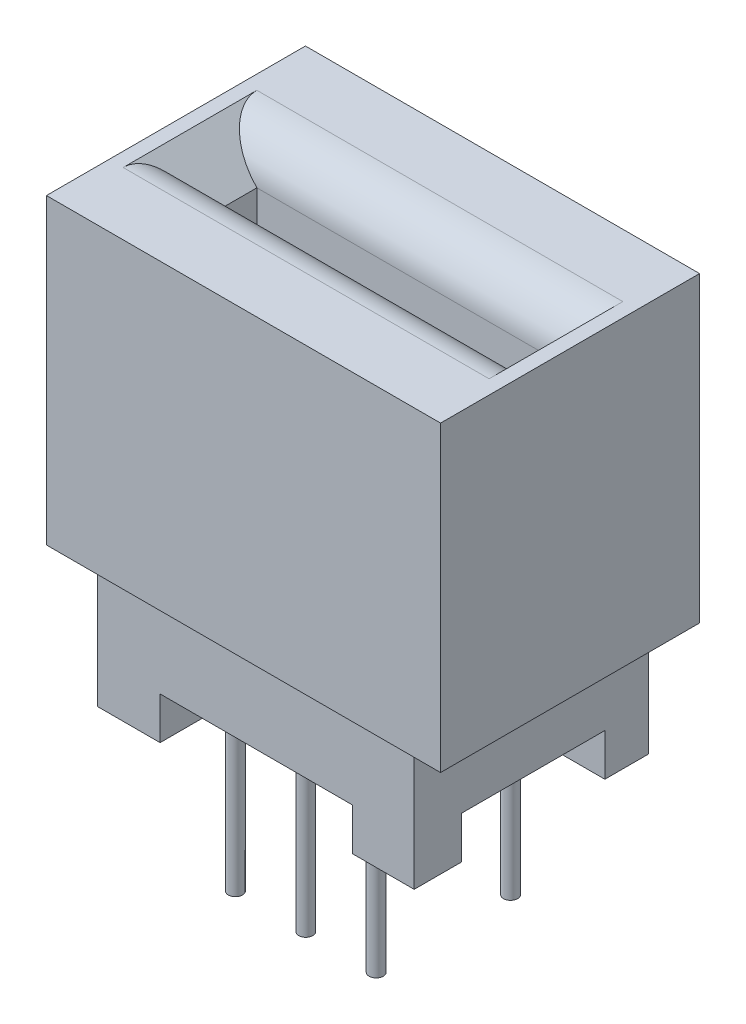
ISO-10303-21;
HEADER;
FILE_DESCRIPTION(('STEP AP214'),'2;1');
FILE_NAME('part.step','',(''),(''),'','','');
FILE_SCHEMA(('AUTOMOTIVE_DESIGN { 1 0 10303 214 1 1 1 1 }'));
ENDSEC;
DATA;
#1=APPLICATION_CONTEXT('core data for automotive mechanical design processes');
#2=APPLICATION_PROTOCOL_DEFINITION('international standard','automotive_design',2000,#1);
#3=PRODUCT_CONTEXT('',#1,'mechanical');
#4=PRODUCT('Part','Part','',(#3));
#5=PRODUCT_RELATED_PRODUCT_CATEGORY('part','',(#4));
#6=PRODUCT_DEFINITION_FORMATION('','',#4);
#7=PRODUCT_DEFINITION_CONTEXT('part definition',#1,'design');
#8=PRODUCT_DEFINITION('design','',#6,#7);
#9=PRODUCT_DEFINITION_SHAPE('','',#8);
#10=(LENGTH_UNIT() NAMED_UNIT(*) SI_UNIT(.MILLI.,.METRE.));
#11=(NAMED_UNIT(*) PLANE_ANGLE_UNIT() SI_UNIT($,.RADIAN.));
#12=(NAMED_UNIT(*) SI_UNIT($,.STERADIAN.) SOLID_ANGLE_UNIT());
#13=UNCERTAINTY_MEASURE_WITH_UNIT(LENGTH_MEASURE(1.E-05),#10,'distance_accuracy_value','');
#14=(GEOMETRIC_REPRESENTATION_CONTEXT(3) GLOBAL_UNCERTAINTY_ASSIGNED_CONTEXT((#13)) GLOBAL_UNIT_ASSIGNED_CONTEXT((#10,
#11,#12)) REPRESENTATION_CONTEXT('',''));
#15=CARTESIAN_POINT('',(0.,0.,0.));
#16=DIRECTION('',(0.,0.,1.));
#17=DIRECTION('',(1.,0.,0.));
#18=AXIS2_PLACEMENT_3D('',#15,#16,#17);
#19=CARTESIAN_POINT('',(-5.715,-13.97,-4.22910624853925));
#20=DIRECTION('',(0.,-1.,0.));
#21=DIRECTION('',(0.,0.,-1.));
#22=AXIS2_PLACEMENT_3D('',#19,#20,#21);
#23=PLANE('',#22);
#24=CARTESIAN_POINT('',(-2.54,-13.97,-2.4257));
#25=DIRECTION('',(0.,-1.,0.));
#26=DIRECTION('',(0.,0.,-1.));
#27=AXIS2_PLACEMENT_3D('',#24,#25,#26);
#28=CIRCLE('',#27,0.254);
#29=CARTESIAN_POINT('',(-2.54,-13.97,-2.6797));
#30=VERTEX_POINT('',#29);
#31=EDGE_CURVE('E246',#30,#30,#28,.T.);
#32=ORIENTED_EDGE('',*,*,#31,.F.);
#33=EDGE_LOOP('',(#32));
#34=FACE_BOUND('',#33,.T.);
#35=DIRECTION('',(-1.,0.,0.));
#36=VECTOR('',#35,1.);
#37=CARTESIAN_POINT('',(-5.715,-13.97,-2.65286698114892));
#38=LINE('',#37,#36);
#39=CARTESIAN_POINT('',(-3.45506017969269,-13.97,-2.65286698114892));
#40=VERTEX_POINT('',#39);
#41=CARTESIAN_POINT('',(-5.715,-13.97,-2.65286698114892));
#42=VERTEX_POINT('',#41);
#43=EDGE_CURVE('E257',#40,#42,#38,.T.);
#44=ORIENTED_EDGE('',*,*,#43,.F.);
#45=DIRECTION('',(0.,0.,1.));
#46=VECTOR('',#45,1.);
#47=CARTESIAN_POINT('',(-3.45506017969269,-13.97,-4.22910624853925));
#48=LINE('',#47,#46);
#49=CARTESIAN_POINT('',(-3.45506017969269,-13.97,-4.22910624853925));
#50=VERTEX_POINT('',#49);
#51=EDGE_CURVE('E250',#50,#40,#48,.T.);
#52=ORIENTED_EDGE('',*,*,#51,.F.);
#53=DIRECTION('',(1.,0.,0.));
#54=VECTOR('',#53,1.);
#55=CARTESIAN_POINT('',(-5.715,-13.97,-4.22910624853925));
#56=LINE('',#55,#54);
#57=CARTESIAN_POINT('',(3.48320730946616,-13.97,-4.22910624853925));
#58=VERTEX_POINT('',#57);
#59=EDGE_CURVE('E415',#50,#58,#56,.T.);
#60=ORIENTED_EDGE('',*,*,#59,.T.);
#61=DIRECTION('',(0.,0.,-1.));
#62=VECTOR('',#61,1.);
#63=CARTESIAN_POINT('',(3.48320730946616,-13.97,-4.22910624853925));
#64=LINE('',#63,#62);
#65=CARTESIAN_POINT('',(3.48320730946616,-13.97,-2.65286698114892));
#66=VERTEX_POINT('',#65);
#67=EDGE_CURVE('E281',#66,#58,#64,.T.);
#68=ORIENTED_EDGE('',*,*,#67,.F.);
#69=DIRECTION('',(-1.,0.,0.));
#70=VECTOR('',#69,1.);
#71=CARTESIAN_POINT('',(5.715,-13.97,-2.65286698114892));
#72=LINE('',#71,#70);
#73=CARTESIAN_POINT('',(5.715,-13.97,-2.65286698114892));
#74=VERTEX_POINT('',#73);
#75=EDGE_CURVE('E276',#74,#66,#72,.T.);
#76=ORIENTED_EDGE('',*,*,#75,.F.);
#77=DIRECTION('',(0.,0.,1.));
#78=VECTOR('',#77,1.);
#79=CARTESIAN_POINT('',(5.715,-13.97,4.22910624853925));
#80=LINE('',#79,#78);
#81=CARTESIAN_POINT('',(5.715,-13.97,2.52620489716843));
#82=VERTEX_POINT('',#81);
#83=EDGE_CURVE('E354',#74,#82,#80,.T.);
#84=ORIENTED_EDGE('',*,*,#83,.T.);
#85=DIRECTION('',(1.,0.,0.));
#86=VECTOR('',#85,1.);
#87=CARTESIAN_POINT('',(5.715,-13.97,2.52620489716843));
#88=LINE('',#87,#86);
#89=CARTESIAN_POINT('',(3.48320730946616,-13.97,2.52620489716843));
#90=VERTEX_POINT('',#89);
#91=EDGE_CURVE('E306',#90,#82,#88,.T.);
#92=ORIENTED_EDGE('',*,*,#91,.F.);
#93=DIRECTION('',(0.,0.,-1.));
#94=VECTOR('',#93,1.);
#95=CARTESIAN_POINT('',(3.48320730946616,-13.97,4.22910624853925));
#96=LINE('',#95,#94);
#97=CARTESIAN_POINT('',(3.48320730946616,-13.97,4.22910624853925));
#98=VERTEX_POINT('',#97);
#99=EDGE_CURVE('E301',#98,#90,#96,.T.);
#100=ORIENTED_EDGE('',*,*,#99,.F.);
#101=DIRECTION('',(-1.,0.,0.));
#102=VECTOR('',#101,1.);
#103=CARTESIAN_POINT('',(-5.715,-13.97,4.22910624853925));
#104=LINE('',#103,#102);
#105=CARTESIAN_POINT('',(-3.45506017969269,-13.97,4.22910624853925));
#106=VERTEX_POINT('',#105);
#107=EDGE_CURVE('E350',#98,#106,#104,.T.);
#108=ORIENTED_EDGE('',*,*,#107,.T.);
#109=DIRECTION('',(0.,0.,1.));
#110=VECTOR('',#109,1.);
#111=CARTESIAN_POINT('',(-3.45506017969269,-13.97,4.22910624853925));
#112=LINE('',#111,#110);
#113=CARTESIAN_POINT('',(-3.45506017969269,-13.97,2.52620489716843));
#114=VERTEX_POINT('',#113);
#115=EDGE_CURVE('E328',#114,#106,#112,.T.);
#116=ORIENTED_EDGE('',*,*,#115,.F.);
#117=DIRECTION('',(1.,0.,0.));
#118=VECTOR('',#117,1.);
#119=CARTESIAN_POINT('',(-5.715,-13.97,2.52620489716843));
#120=LINE('',#119,#118);
#121=CARTESIAN_POINT('',(-5.715,-13.97,2.52620489716843));
#122=VERTEX_POINT('',#121);
#123=EDGE_CURVE('E323',#122,#114,#120,.T.);
#124=ORIENTED_EDGE('',*,*,#123,.F.);
#125=DIRECTION('',(0.,0.,-1.));
#126=VECTOR('',#125,1.);
#127=CARTESIAN_POINT('',(-5.715,-13.97,4.22910624853925));
#128=LINE('',#127,#126);
#129=EDGE_CURVE('E372',#122,#42,#128,.T.);
#130=ORIENTED_EDGE('',*,*,#129,.T.);
#131=EDGE_LOOP('',(#44,#52,#60,#68,#76,#84,#92,#100,#108,#116,#124,#130));
#132=FACE_BOUND('',#131,.T.);
#133=CARTESIAN_POINT('',(0.,-13.97,-2.4257));
#134=DIRECTION('',(0.,-1.,0.));
#135=DIRECTION('',(0.,0.,-1.));
#136=AXIS2_PLACEMENT_3D('',#133,#134,#135);
#137=CIRCLE('',#136,0.254);
#138=CARTESIAN_POINT('',(0.,-13.97,-2.6797));
#139=VERTEX_POINT('',#138);
#140=EDGE_CURVE('E236',#139,#139,#137,.T.);
#141=ORIENTED_EDGE('',*,*,#140,.F.);
#142=EDGE_LOOP('',(#141));
#143=FACE_BOUND('',#142,.T.);
#144=CARTESIAN_POINT('',(2.54,-13.97,-2.4257));
#145=DIRECTION('',(0.,-1.,0.));
#146=DIRECTION('',(0.,0.,-1.));
#147=AXIS2_PLACEMENT_3D('',#144,#145,#146);
#148=CIRCLE('',#147,0.254);
#149=CARTESIAN_POINT('',(2.54,-13.97,-2.6797));
#150=VERTEX_POINT('',#149);
#151=EDGE_CURVE('E355',#150,#150,#148,.T.);
#152=ORIENTED_EDGE('',*,*,#151,.F.);
#153=EDGE_LOOP('',(#152));
#154=FACE_BOUND('',#153,.T.);
#155=CARTESIAN_POINT('',(-2.54,-13.97,2.4257));
#156=DIRECTION('',(0.,-1.,0.));
#157=DIRECTION('',(0.,0.,-1.));
#158=AXIS2_PLACEMENT_3D('',#155,#156,#157);
#159=CIRCLE('',#158,0.254);
#160=CARTESIAN_POINT('',(-2.54,-13.97,2.1717));
#161=VERTEX_POINT('',#160);
#162=EDGE_CURVE('E617',#161,#161,#159,.T.);
#163=ORIENTED_EDGE('',*,*,#162,.F.);
#164=EDGE_LOOP('',(#163));
#165=FACE_BOUND('',#164,.T.);
#166=CARTESIAN_POINT('',(0.,-13.97,2.4257));
#167=DIRECTION('',(0.,-1.,0.));
#168=DIRECTION('',(0.,0.,-1.));
#169=AXIS2_PLACEMENT_3D('',#166,#167,#168);
#170=CIRCLE('',#169,0.254);
#171=CARTESIAN_POINT('',(0.,-13.97,2.1717));
#172=VERTEX_POINT('',#171);
#173=EDGE_CURVE('E611',#172,#172,#170,.T.);
#174=ORIENTED_EDGE('',*,*,#173,.F.);
#175=EDGE_LOOP('',(#174));
#176=FACE_BOUND('',#175,.T.);
#177=CARTESIAN_POINT('',(2.54,-13.97,2.4257));
#178=DIRECTION('',(0.,-1.,0.));
#179=DIRECTION('',(0.,0.,-1.));
#180=AXIS2_PLACEMENT_3D('',#177,#178,#179);
#181=CIRCLE('',#180,0.254);
#182=CARTESIAN_POINT('',(2.54,-13.97,2.1717));
#183=VERTEX_POINT('',#182);
#184=EDGE_CURVE('E605',#183,#183,#181,.T.);
#185=ORIENTED_EDGE('',*,*,#184,.F.);
#186=EDGE_LOOP('',(#185));
#187=FACE_BOUND('',#186,.T.);
#188=ADVANCED_FACE('F31',(#34,#132,#143,#154,#165,#176,#187),#23,.T.);
#189=CARTESIAN_POINT('',(-7.112,-10.922,-4.6736));
#190=DIRECTION('',(0.,-1.,0.));
#191=DIRECTION('',(0.,0.,-1.));
#192=AXIS2_PLACEMENT_3D('',#189,#190,#191);
#193=PLANE('',#192);
#194=DIRECTION('',(0.,0.,1.));
#195=VECTOR('',#194,1.);
#196=CARTESIAN_POINT('',(-7.112,-10.922,4.6736));
#197=LINE('',#196,#195);
#198=CARTESIAN_POINT('',(-7.112,-10.922,-4.6736));
#199=VERTEX_POINT('',#198);
#200=CARTESIAN_POINT('',(-7.112,-10.922,4.6736));
#201=VERTEX_POINT('',#200);
#202=EDGE_CURVE('E383',#199,#201,#197,.T.);
#203=ORIENTED_EDGE('',*,*,#202,.F.);
#204=DIRECTION('',(-1.,0.,0.));
#205=VECTOR('',#204,1.);
#206=CARTESIAN_POINT('',(-7.112,-10.922,-4.6736));
#207=LINE('',#206,#205);
#208=CARTESIAN_POINT('',(7.112,-10.922,-4.6736));
#209=VERTEX_POINT('',#208);
#210=EDGE_CURVE('E393',#209,#199,#207,.T.);
#211=ORIENTED_EDGE('',*,*,#210,.F.);
#212=DIRECTION('',(0.,0.,-1.));
#213=VECTOR('',#212,1.);
#214=CARTESIAN_POINT('',(7.112,-10.922,4.6736));
#215=LINE('',#214,#213);
#216=CARTESIAN_POINT('',(7.112,-10.922,4.6736));
#217=VERTEX_POINT('',#216);
#218=EDGE_CURVE('E390',#217,#209,#215,.T.);
#219=ORIENTED_EDGE('',*,*,#218,.F.);
#220=DIRECTION('',(1.,0.,0.));
#221=VECTOR('',#220,1.);
#222=CARTESIAN_POINT('',(-7.112,-10.922,4.6736));
#223=LINE('',#222,#221);
#224=EDGE_CURVE('E386',#201,#217,#223,.T.);
#225=ORIENTED_EDGE('',*,*,#224,.F.);
#226=EDGE_LOOP('',(#203,#211,#219,#225));
#227=FACE_BOUND('',#226,.T.);
#228=DIRECTION('',(1.,0.,0.));
#229=VECTOR('',#228,1.);
#230=CARTESIAN_POINT('',(-5.715,-10.922,-4.22910624853925));
#231=LINE('',#230,#229);
#232=CARTESIAN_POINT('',(-5.715,-10.922,-4.22910624853925));
#233=VERTEX_POINT('',#232);
#234=CARTESIAN_POINT('',(5.715,-10.922,-4.22910624853925));
#235=VERTEX_POINT('',#234);
#236=EDGE_CURVE('E364',#233,#235,#231,.T.);
#237=ORIENTED_EDGE('',*,*,#236,.F.);
#238=DIRECTION('',(0.,0.,-1.));
#239=VECTOR('',#238,1.);
#240=CARTESIAN_POINT('',(-5.715,-10.922,4.22910624853925));
#241=LINE('',#240,#239);
#242=CARTESIAN_POINT('',(-5.715,-10.922,4.22910624853925));
#243=VERTEX_POINT('',#242);
#244=EDGE_CURVE('E361',#243,#233,#241,.T.);
#245=ORIENTED_EDGE('',*,*,#244,.F.);
#246=DIRECTION('',(-1.,0.,0.));
#247=VECTOR('',#246,1.);
#248=CARTESIAN_POINT('',(-5.715,-10.922,4.22910624853925));
#249=LINE('',#248,#247);
#250=CARTESIAN_POINT('',(5.715,-10.922,4.22910624853925));
#251=VERTEX_POINT('',#250);
#252=EDGE_CURVE('E370',#251,#243,#249,.T.);
#253=ORIENTED_EDGE('',*,*,#252,.F.);
#254=DIRECTION('',(0.,0.,1.));
#255=VECTOR('',#254,1.);
#256=CARTESIAN_POINT('',(5.715,-10.922,4.22910624853925));
#257=LINE('',#256,#255);
#258=EDGE_CURVE('E367',#235,#251,#257,.T.);
#259=ORIENTED_EDGE('',*,*,#258,.F.);
#260=EDGE_LOOP('',(#237,#245,#253,#259));
#261=FACE_BOUND('',#260,.T.);
#262=ADVANCED_FACE('F494',(#227,#261),#193,.T.);
#263=CARTESIAN_POINT('',(-7.112,-10.922,4.6736));
#264=DIRECTION('',(-1.,0.,0.));
#265=DIRECTION('',(0.,0.,1.));
#266=AXIS2_PLACEMENT_3D('',#263,#264,#265);
#267=PLANE('',#266);
#268=DIRECTION('',(0.,0.,1.));
#269=VECTOR('',#268,1.);
#270=CARTESIAN_POINT('',(-7.112,0.,4.6736));
#271=LINE('',#270,#269);
#272=CARTESIAN_POINT('',(-7.112,0.,-4.6736));
#273=VERTEX_POINT('',#272);
#274=CARTESIAN_POINT('',(-7.112,0.,4.6736));
#275=VERTEX_POINT('',#274);
#276=EDGE_CURVE('E382',#273,#275,#271,.T.);
#277=ORIENTED_EDGE('',*,*,#276,.F.);
#278=DIRECTION('',(0.,1.,0.));
#279=VECTOR('',#278,1.);
#280=CARTESIAN_POINT('',(-7.112,-10.922,-4.6736));
#281=LINE('',#280,#279);
#282=EDGE_CURVE('E407',#199,#273,#281,.T.);
#283=ORIENTED_EDGE('',*,*,#282,.F.);
#284=ORIENTED_EDGE('',*,*,#202,.T.);
#285=DIRECTION('',(0.,1.,0.));
#286=VECTOR('',#285,1.);
#287=CARTESIAN_POINT('',(-7.112,-10.922,4.6736));
#288=LINE('',#287,#286);
#289=EDGE_CURVE('E396',#201,#275,#288,.T.);
#290=ORIENTED_EDGE('',*,*,#289,.T.);
#291=EDGE_LOOP('',(#277,#283,#284,#290));
#292=FACE_BOUND('',#291,.T.);
#293=ADVANCED_FACE('F500',(#292),#267,.T.);
#294=CARTESIAN_POINT('',(-7.112,-10.922,-4.6736));
#295=DIRECTION('',(0.,0.,-1.));
#296=DIRECTION('',(-1.,0.,0.));
#297=AXIS2_PLACEMENT_3D('',#294,#295,#296);
#298=PLANE('',#297);
#299=DIRECTION('',(-1.,0.,0.));
#300=VECTOR('',#299,1.);
#301=CARTESIAN_POINT('',(-7.112,0.,-4.6736));
#302=LINE('',#301,#300);
#303=CARTESIAN_POINT('',(7.112,0.,-4.6736));
#304=VERTEX_POINT('',#303);
#305=EDGE_CURVE('E387',#304,#273,#302,.T.);
#306=ORIENTED_EDGE('',*,*,#305,.F.);
#307=DIRECTION('',(0.,1.,0.));
#308=VECTOR('',#307,1.);
#309=CARTESIAN_POINT('',(7.112,-10.922,-4.6736));
#310=LINE('',#309,#308);
#311=EDGE_CURVE('E409',#209,#304,#310,.T.);
#312=ORIENTED_EDGE('',*,*,#311,.F.);
#313=ORIENTED_EDGE('',*,*,#210,.T.);
#314=ORIENTED_EDGE('',*,*,#282,.T.);
#315=EDGE_LOOP('',(#306,#312,#313,#314));
#316=FACE_BOUND('',#315,.T.);
#317=ADVANCED_FACE('F519',(#316),#298,.T.);
#318=CARTESIAN_POINT('',(7.112,-10.922,4.6736));
#319=DIRECTION('',(1.,0.,0.));
#320=DIRECTION('',(0.,0.,-1.));
#321=AXIS2_PLACEMENT_3D('',#318,#319,#320);
#322=PLANE('',#321);
#323=DIRECTION('',(0.,0.,-1.));
#324=VECTOR('',#323,1.);
#325=CARTESIAN_POINT('',(7.112,0.,4.6736));
#326=LINE('',#325,#324);
#327=CARTESIAN_POINT('',(7.112,0.,4.6736));
#328=VERTEX_POINT('',#327);
#329=EDGE_CURVE('E402',#328,#304,#326,.T.);
#330=ORIENTED_EDGE('',*,*,#329,.F.);
#331=DIRECTION('',(0.,1.,0.));
#332=VECTOR('',#331,1.);
#333=CARTESIAN_POINT('',(7.112,-10.922,4.6736));
#334=LINE('',#333,#332);
#335=EDGE_CURVE('E411',#217,#328,#334,.T.);
#336=ORIENTED_EDGE('',*,*,#335,.F.);
#337=ORIENTED_EDGE('',*,*,#218,.T.);
#338=ORIENTED_EDGE('',*,*,#311,.T.);
#339=EDGE_LOOP('',(#330,#336,#337,#338));
#340=FACE_BOUND('',#339,.T.);
#341=ADVANCED_FACE('F522',(#340),#322,.T.);
#342=CARTESIAN_POINT('',(-7.112,-10.922,4.6736));
#343=DIRECTION('',(0.,0.,1.));
#344=DIRECTION('',(1.,0.,0.));
#345=AXIS2_PLACEMENT_3D('',#342,#343,#344);
#346=PLANE('',#345);
#347=DIRECTION('',(1.,0.,0.));
#348=VECTOR('',#347,1.);
#349=CARTESIAN_POINT('',(-7.112,0.,4.6736));
#350=LINE('',#349,#348);
#351=EDGE_CURVE('E399',#275,#328,#350,.T.);
#352=ORIENTED_EDGE('',*,*,#351,.F.);
#353=ORIENTED_EDGE('',*,*,#289,.F.);
#354=ORIENTED_EDGE('',*,*,#224,.T.);
#355=ORIENTED_EDGE('',*,*,#335,.T.);
#356=EDGE_LOOP('',(#352,#353,#354,#355));
#357=FACE_BOUND('',#356,.T.);
#358=ADVANCED_FACE('F518',(#357),#346,.T.);
#359=CARTESIAN_POINT('',(-7.112,0.,-4.6736));
#360=DIRECTION('',(0.,-1.,0.));
#361=DIRECTION('',(0.,0.,-1.));
#362=AXIS2_PLACEMENT_3D('',#359,#360,#361);
#363=PLANE('',#362);
#364=DIRECTION('',(0.,0.,1.));
#365=VECTOR('',#364,1.);
#366=CARTESIAN_POINT('',(6.604,0.,-4.6736));
#367=LINE('',#366,#365);
#368=CARTESIAN_POINT('',(6.604,0.,-2.413));
#369=VERTEX_POINT('',#368);
#370=CARTESIAN_POINT('',(6.604,0.,2.413));
#371=VERTEX_POINT('',#370);
#372=EDGE_CURVE('E46',#369,#371,#367,.T.);
#373=ORIENTED_EDGE('',*,*,#372,.T.);
#374=DIRECTION('',(1.,0.,0.));
#375=VECTOR('',#374,1.);
#376=CARTESIAN_POINT('',(-7.112,0.,2.413));
#377=LINE('',#376,#375);
#378=CARTESIAN_POINT('',(-6.604,0.,2.413));
#379=VERTEX_POINT('',#378);
#380=EDGE_CURVE('E583',#371,#379,#377,.F.);
#381=ORIENTED_EDGE('',*,*,#380,.T.);
#382=DIRECTION('',(0.,0.,-1.));
#383=VECTOR('',#382,1.);
#384=CARTESIAN_POINT('',(-6.604,0.,-4.6736));
#385=LINE('',#384,#383);
#386=CARTESIAN_POINT('',(-6.604,0.,-2.413));
#387=VERTEX_POINT('',#386);
#388=EDGE_CURVE('E54',#379,#387,#385,.T.);
#389=ORIENTED_EDGE('',*,*,#388,.T.);
#390=DIRECTION('',(-1.,0.,0.));
#391=VECTOR('',#390,1.);
#392=CARTESIAN_POINT('',(-7.112,0.,-2.413));
#393=LINE('',#392,#391);
#394=EDGE_CURVE('E593',#387,#369,#393,.F.);
#395=ORIENTED_EDGE('',*,*,#394,.T.);
#396=EDGE_LOOP('',(#373,#381,#389,#395));
#397=FACE_BOUND('',#396,.T.);
#398=ORIENTED_EDGE('',*,*,#276,.T.);
#399=ORIENTED_EDGE('',*,*,#351,.T.);
#400=ORIENTED_EDGE('',*,*,#329,.T.);
#401=ORIENTED_EDGE('',*,*,#305,.T.);
#402=EDGE_LOOP('',(#398,#399,#400,#401));
#403=FACE_BOUND('',#402,.T.);
#404=ADVANCED_FACE('F514',(#397,#403),#363,.F.);
#405=CARTESIAN_POINT('',(-5.715,-13.97,4.22910624853925));
#406=DIRECTION('',(1.,0.,0.));
#407=DIRECTION('',(0.,0.,-1.));
#408=AXIS2_PLACEMENT_3D('',#405,#406,#407);
#409=PLANE('',#408);
#410=ORIENTED_EDGE('',*,*,#244,.T.);
#411=DIRECTION('',(0.,1.,0.));
#412=VECTOR('',#411,1.);
#413=CARTESIAN_POINT('',(-5.715,-13.97,-4.22910624853925));
#414=LINE('',#413,#412);
#415=CARTESIAN_POINT('',(-5.715,-15.494,-4.22910624853925));
#416=VERTEX_POINT('',#415);
#417=EDGE_CURVE('E380',#416,#233,#414,.T.);
#418=ORIENTED_EDGE('',*,*,#417,.F.);
#419=DIRECTION('',(0.,0.,-1.));
#420=VECTOR('',#419,1.);
#421=CARTESIAN_POINT('',(-5.715,-15.494,-4.22910624853925));
#422=LINE('',#421,#420);
#423=CARTESIAN_POINT('',(-5.715,-15.494,-2.65286698114892));
#424=VERTEX_POINT('',#423);
#425=EDGE_CURVE('E253',#424,#416,#422,.T.);
#426=ORIENTED_EDGE('',*,*,#425,.F.);
#427=DIRECTION('',(0.,1.,0.));
#428=VECTOR('',#427,1.);
#429=CARTESIAN_POINT('',(-5.715,-15.494,-2.65286698114892));
#430=LINE('',#429,#428);
#431=EDGE_CURVE('E263',#424,#42,#430,.T.);
#432=ORIENTED_EDGE('',*,*,#431,.T.);
#433=ORIENTED_EDGE('',*,*,#129,.F.);
#434=DIRECTION('',(0.,1.,0.));
#435=VECTOR('',#434,1.);
#436=CARTESIAN_POINT('',(-5.715,-15.494,2.52620489716843));
#437=LINE('',#436,#435);
#438=CARTESIAN_POINT('',(-5.715,-15.494,2.52620489716843));
#439=VERTEX_POINT('',#438);
#440=EDGE_CURVE('E365',#439,#122,#437,.T.);
#441=ORIENTED_EDGE('',*,*,#440,.F.);
#442=DIRECTION('',(0.,0.,-1.));
#443=VECTOR('',#442,1.);
#444=CARTESIAN_POINT('',(-5.715,-15.494,4.22910624853925));
#445=LINE('',#444,#443);
#446=CARTESIAN_POINT('',(-5.715,-15.494,4.22910624853925));
#447=VERTEX_POINT('',#446);
#448=EDGE_CURVE('E324',#447,#439,#445,.T.);
#449=ORIENTED_EDGE('',*,*,#448,.F.);
#450=DIRECTION('',(0.,1.,0.));
#451=VECTOR('',#450,1.);
#452=CARTESIAN_POINT('',(-5.715,-13.97,4.22910624853925));
#453=LINE('',#452,#451);
#454=EDGE_CURVE('E353',#447,#243,#453,.T.);
#455=ORIENTED_EDGE('',*,*,#454,.T.);
#456=EDGE_LOOP('',(#410,#418,#426,#432,#433,#441,#449,#455));
#457=FACE_BOUND('',#456,.T.);
#458=ADVANCED_FACE('F459',(#457),#409,.F.);
#459=CARTESIAN_POINT('',(-5.715,-13.97,-4.22910624853925));
#460=DIRECTION('',(0.,0.,1.));
#461=DIRECTION('',(1.,0.,0.));
#462=AXIS2_PLACEMENT_3D('',#459,#460,#461);
#463=PLANE('',#462);
#464=ORIENTED_EDGE('',*,*,#236,.T.);
#465=DIRECTION('',(0.,1.,0.));
#466=VECTOR('',#465,1.);
#467=CARTESIAN_POINT('',(5.715,-13.97,-4.22910624853925));
#468=LINE('',#467,#466);
#469=CARTESIAN_POINT('',(5.715,-15.494,-4.22910624853925));
#470=VERTEX_POINT('',#469);
#471=EDGE_CURVE('E377',#470,#235,#468,.T.);
#472=ORIENTED_EDGE('',*,*,#471,.F.);
#473=DIRECTION('',(1.,0.,0.));
#474=VECTOR('',#473,1.);
#475=CARTESIAN_POINT('',(5.715,-15.494,-4.22910624853925));
#476=LINE('',#475,#474);
#477=CARTESIAN_POINT('',(3.48320730946616,-15.494,-4.22910624853925));
#478=VERTEX_POINT('',#477);
#479=EDGE_CURVE('E285',#478,#470,#476,.T.);
#480=ORIENTED_EDGE('',*,*,#479,.F.);
#481=DIRECTION('',(0.,1.,0.));
#482=VECTOR('',#481,1.);
#483=CARTESIAN_POINT('',(3.48320730946616,-15.494,-4.22910624853925));
#484=LINE('',#483,#482);
#485=EDGE_CURVE('E288',#478,#58,#484,.T.);
#486=ORIENTED_EDGE('',*,*,#485,.T.);
#487=ORIENTED_EDGE('',*,*,#59,.F.);
#488=DIRECTION('',(0.,1.,0.));
#489=VECTOR('',#488,1.);
#490=CARTESIAN_POINT('',(-3.45506017969269,-15.494,-4.22910624853925));
#491=LINE('',#490,#489);
#492=CARTESIAN_POINT('',(-3.45506017969269,-15.494,-4.22910624853925));
#493=VERTEX_POINT('',#492);
#494=EDGE_CURVE('E273',#493,#50,#491,.T.);
#495=ORIENTED_EDGE('',*,*,#494,.F.);
#496=DIRECTION('',(1.,0.,0.));
#497=VECTOR('',#496,1.);
#498=CARTESIAN_POINT('',(-5.715,-15.494,-4.22910624853925));
#499=LINE('',#498,#497);
#500=EDGE_CURVE('E256',#416,#493,#499,.T.);
#501=ORIENTED_EDGE('',*,*,#500,.F.);
#502=ORIENTED_EDGE('',*,*,#417,.T.);
#503=EDGE_LOOP('',(#464,#472,#480,#486,#487,#495,#501,#502));
#504=FACE_BOUND('',#503,.T.);
#505=ADVANCED_FACE('F472',(#504),#463,.F.);
#506=CARTESIAN_POINT('',(5.715,-13.97,4.22910624853925));
#507=DIRECTION('',(-1.,0.,0.));
#508=DIRECTION('',(0.,0.,1.));
#509=AXIS2_PLACEMENT_3D('',#506,#507,#508);
#510=PLANE('',#509);
#511=ORIENTED_EDGE('',*,*,#258,.T.);
#512=DIRECTION('',(0.,1.,0.));
#513=VECTOR('',#512,1.);
#514=CARTESIAN_POINT('',(5.715,-13.97,4.22910624853925));
#515=LINE('',#514,#513);
#516=CARTESIAN_POINT('',(5.715,-15.494,4.22910624853925));
#517=VERTEX_POINT('',#516);
#518=EDGE_CURVE('E375',#517,#251,#515,.T.);
#519=ORIENTED_EDGE('',*,*,#518,.F.);
#520=DIRECTION('',(0.,0.,1.));
#521=VECTOR('',#520,1.);
#522=CARTESIAN_POINT('',(5.715,-15.494,4.22910624853925));
#523=LINE('',#522,#521);
#524=CARTESIAN_POINT('',(5.715,-15.494,2.52620489716843));
#525=VERTEX_POINT('',#524);
#526=EDGE_CURVE('E302',#525,#517,#523,.T.);
#527=ORIENTED_EDGE('',*,*,#526,.F.);
#528=DIRECTION('',(0.,1.,0.));
#529=VECTOR('',#528,1.);
#530=CARTESIAN_POINT('',(5.715,-15.494,2.52620489716843));
#531=LINE('',#530,#529);
#532=EDGE_CURVE('E312',#525,#82,#531,.T.);
#533=ORIENTED_EDGE('',*,*,#532,.T.);
#534=ORIENTED_EDGE('',*,*,#83,.F.);
#535=DIRECTION('',(0.,1.,0.));
#536=VECTOR('',#535,1.);
#537=CARTESIAN_POINT('',(5.715,-15.494,-2.65286698114892));
#538=LINE('',#537,#536);
#539=CARTESIAN_POINT('',(5.715,-15.494,-2.65286698114892));
#540=VERTEX_POINT('',#539);
#541=EDGE_CURVE('E298',#540,#74,#538,.T.);
#542=ORIENTED_EDGE('',*,*,#541,.F.);
#543=DIRECTION('',(0.,0.,1.));
#544=VECTOR('',#543,1.);
#545=CARTESIAN_POINT('',(5.715,-15.494,-4.22910624853925));
#546=LINE('',#545,#544);
#547=EDGE_CURVE('E277',#470,#540,#546,.T.);
#548=ORIENTED_EDGE('',*,*,#547,.F.);
#549=ORIENTED_EDGE('',*,*,#471,.T.);
#550=EDGE_LOOP('',(#511,#519,#527,#533,#534,#542,#548,#549));
#551=FACE_BOUND('',#550,.T.);
#552=ADVANCED_FACE('F432',(#551),#510,.F.);
#553=CARTESIAN_POINT('',(-5.715,-13.97,4.22910624853925));
#554=DIRECTION('',(0.,0.,-1.));
#555=DIRECTION('',(-1.,0.,0.));
#556=AXIS2_PLACEMENT_3D('',#553,#554,#555);
#557=PLANE('',#556);
#558=ORIENTED_EDGE('',*,*,#252,.T.);
#559=ORIENTED_EDGE('',*,*,#454,.F.);
#560=DIRECTION('',(-1.,0.,0.));
#561=VECTOR('',#560,1.);
#562=CARTESIAN_POINT('',(-5.715,-15.494,4.22910624853925));
#563=LINE('',#562,#561);
#564=CARTESIAN_POINT('',(-3.45506017969269,-15.494,4.22910624853925));
#565=VERTEX_POINT('',#564);
#566=EDGE_CURVE('E332',#565,#447,#563,.T.);
#567=ORIENTED_EDGE('',*,*,#566,.F.);
#568=DIRECTION('',(0.,1.,0.));
#569=VECTOR('',#568,1.);
#570=CARTESIAN_POINT('',(-3.45506017969269,-15.494,4.22910624853925));
#571=LINE('',#570,#569);
#572=EDGE_CURVE('E335',#565,#106,#571,.T.);
#573=ORIENTED_EDGE('',*,*,#572,.T.);
#574=ORIENTED_EDGE('',*,*,#107,.F.);
#575=DIRECTION('',(0.,1.,0.));
#576=VECTOR('',#575,1.);
#577=CARTESIAN_POINT('',(3.48320730946616,-15.494,4.22910624853925));
#578=LINE('',#577,#576);
#579=CARTESIAN_POINT('',(3.48320730946616,-15.494,4.22910624853925));
#580=VERTEX_POINT('',#579);
#581=EDGE_CURVE('E321',#580,#98,#578,.T.);
#582=ORIENTED_EDGE('',*,*,#581,.F.);
#583=DIRECTION('',(-1.,0.,0.));
#584=VECTOR('',#583,1.);
#585=CARTESIAN_POINT('',(5.715,-15.494,4.22910624853925));
#586=LINE('',#585,#584);
#587=EDGE_CURVE('E305',#517,#580,#586,.T.);
#588=ORIENTED_EDGE('',*,*,#587,.F.);
#589=ORIENTED_EDGE('',*,*,#518,.T.);
#590=EDGE_LOOP('',(#558,#559,#567,#573,#574,#582,#588,#589));
#591=FACE_BOUND('',#590,.T.);
#592=ADVANCED_FACE('F442',(#591),#557,.F.);
#593=CARTESIAN_POINT('',(-5.715,-15.494,2.52620489716843));
#594=DIRECTION('',(0.,0.,1.));
#595=DIRECTION('',(1.,0.,0.));
#596=AXIS2_PLACEMENT_3D('',#593,#594,#595);
#597=PLANE('',#596);
#598=ORIENTED_EDGE('',*,*,#123,.T.);
#599=DIRECTION('',(0.,1.,0.));
#600=VECTOR('',#599,1.);
#601=CARTESIAN_POINT('',(-3.45506017969269,-15.494,2.52620489716843));
#602=LINE('',#601,#600);
#603=CARTESIAN_POINT('',(-3.45506017969269,-15.494,2.52620489716843));
#604=VERTEX_POINT('',#603);
#605=EDGE_CURVE('E338',#604,#114,#602,.T.);
#606=ORIENTED_EDGE('',*,*,#605,.F.);
#607=DIRECTION('',(1.,0.,0.));
#608=VECTOR('',#607,1.);
#609=CARTESIAN_POINT('',(-5.715,-15.494,2.52620489716843));
#610=LINE('',#609,#608);
#611=EDGE_CURVE('E327',#439,#604,#610,.T.);
#612=ORIENTED_EDGE('',*,*,#611,.F.);
#613=ORIENTED_EDGE('',*,*,#440,.T.);
#614=EDGE_LOOP('',(#598,#606,#612,#613));
#615=FACE_BOUND('',#614,.T.);
#616=ADVANCED_FACE('F454',(#615),#597,.F.);
#617=CARTESIAN_POINT('',(-3.45506017969269,-15.494,4.22910624853925));
#618=DIRECTION('',(-1.,0.,0.));
#619=DIRECTION('',(0.,0.,1.));
#620=AXIS2_PLACEMENT_3D('',#617,#618,#619);
#621=PLANE('',#620);
#622=ORIENTED_EDGE('',*,*,#115,.T.);
#623=ORIENTED_EDGE('',*,*,#572,.F.);
#624=DIRECTION('',(0.,0.,1.));
#625=VECTOR('',#624,1.);
#626=CARTESIAN_POINT('',(-3.45506017969269,-15.494,4.22910624853925));
#627=LINE('',#626,#625);
#628=EDGE_CURVE('E330',#604,#565,#627,.T.);
#629=ORIENTED_EDGE('',*,*,#628,.F.);
#630=ORIENTED_EDGE('',*,*,#605,.T.);
#631=EDGE_LOOP('',(#622,#623,#629,#630));
#632=FACE_BOUND('',#631,.T.);
#633=ADVANCED_FACE('F447',(#632),#621,.F.);
#634=CARTESIAN_POINT('',(-5.715,-15.494,2.52620489716843));
#635=DIRECTION('',(0.,-1.,0.));
#636=DIRECTION('',(0.,0.,-1.));
#637=AXIS2_PLACEMENT_3D('',#634,#635,#636);
#638=PLANE('',#637);
#639=ORIENTED_EDGE('',*,*,#448,.T.);
#640=ORIENTED_EDGE('',*,*,#611,.T.);
#641=ORIENTED_EDGE('',*,*,#628,.T.);
#642=ORIENTED_EDGE('',*,*,#566,.T.);
#643=EDGE_LOOP('',(#639,#640,#641,#642));
#644=FACE_BOUND('',#643,.T.);
#645=ADVANCED_FACE('F660',(#644),#638,.T.);
#646=CARTESIAN_POINT('',(3.48320730946616,-15.494,4.22910624853925));
#647=DIRECTION('',(1.,0.,0.));
#648=DIRECTION('',(0.,0.,-1.));
#649=AXIS2_PLACEMENT_3D('',#646,#647,#648);
#650=PLANE('',#649);
#651=ORIENTED_EDGE('',*,*,#99,.T.);
#652=DIRECTION('',(0.,1.,0.));
#653=VECTOR('',#652,1.);
#654=CARTESIAN_POINT('',(3.48320730946616,-15.494,2.52620489716843));
#655=LINE('',#654,#653);
#656=CARTESIAN_POINT('',(3.48320730946616,-15.494,2.52620489716843));
#657=VERTEX_POINT('',#656);
#658=EDGE_CURVE('E319',#657,#90,#655,.T.);
#659=ORIENTED_EDGE('',*,*,#658,.F.);
#660=DIRECTION('',(0.,0.,-1.));
#661=VECTOR('',#660,1.);
#662=CARTESIAN_POINT('',(3.48320730946616,-15.494,4.22910624853925));
#663=LINE('',#662,#661);
#664=EDGE_CURVE('E308',#580,#657,#663,.T.);
#665=ORIENTED_EDGE('',*,*,#664,.F.);
#666=ORIENTED_EDGE('',*,*,#581,.T.);
#667=EDGE_LOOP('',(#651,#659,#665,#666));
#668=FACE_BOUND('',#667,.T.);
#669=ADVANCED_FACE('F439',(#668),#650,.F.);
#670=CARTESIAN_POINT('',(5.715,-15.494,2.52620489716843));
#671=DIRECTION('',(0.,0.,1.));
#672=DIRECTION('',(1.,0.,0.));
#673=AXIS2_PLACEMENT_3D('',#670,#671,#672);
#674=PLANE('',#673);
#675=ORIENTED_EDGE('',*,*,#91,.T.);
#676=ORIENTED_EDGE('',*,*,#532,.F.);
#677=DIRECTION('',(1.,0.,0.));
#678=VECTOR('',#677,1.);
#679=CARTESIAN_POINT('',(5.715,-15.494,2.52620489716843));
#680=LINE('',#679,#678);
#681=EDGE_CURVE('E310',#657,#525,#680,.T.);
#682=ORIENTED_EDGE('',*,*,#681,.F.);
#683=ORIENTED_EDGE('',*,*,#658,.T.);
#684=EDGE_LOOP('',(#675,#676,#682,#683));
#685=FACE_BOUND('',#684,.T.);
#686=ADVANCED_FACE('F428',(#685),#674,.F.);
#687=CARTESIAN_POINT('',(5.715,-15.494,2.52620489716843));
#688=DIRECTION('',(0.,1.,0.));
#689=DIRECTION('',(0.,0.,1.));
#690=AXIS2_PLACEMENT_3D('',#687,#688,#689);
#691=PLANE('',#690);
#692=ORIENTED_EDGE('',*,*,#526,.T.);
#693=ORIENTED_EDGE('',*,*,#587,.T.);
#694=ORIENTED_EDGE('',*,*,#664,.T.);
#695=ORIENTED_EDGE('',*,*,#681,.T.);
#696=EDGE_LOOP('',(#692,#693,#694,#695));
#697=FACE_BOUND('',#696,.T.);
#698=ADVANCED_FACE('F435',(#697),#691,.F.);
#699=CARTESIAN_POINT('',(5.715,-15.494,-2.65286698114892));
#700=DIRECTION('',(0.,0.,-1.));
#701=DIRECTION('',(-1.,0.,0.));
#702=AXIS2_PLACEMENT_3D('',#699,#700,#701);
#703=PLANE('',#702);
#704=ORIENTED_EDGE('',*,*,#75,.T.);
#705=DIRECTION('',(0.,1.,0.));
#706=VECTOR('',#705,1.);
#707=CARTESIAN_POINT('',(3.48320730946616,-15.494,-2.65286698114892));
#708=LINE('',#707,#706);
#709=CARTESIAN_POINT('',(3.48320730946616,-15.494,-2.65286698114892));
#710=VERTEX_POINT('',#709);
#711=EDGE_CURVE('E295',#710,#66,#708,.T.);
#712=ORIENTED_EDGE('',*,*,#711,.F.);
#713=DIRECTION('',(-1.,0.,0.));
#714=VECTOR('',#713,1.);
#715=CARTESIAN_POINT('',(5.715,-15.494,-2.65286698114892));
#716=LINE('',#715,#714);
#717=EDGE_CURVE('E280',#540,#710,#716,.T.);
#718=ORIENTED_EDGE('',*,*,#717,.F.);
#719=ORIENTED_EDGE('',*,*,#541,.T.);
#720=EDGE_LOOP('',(#704,#712,#718,#719));
#721=FACE_BOUND('',#720,.T.);
#722=ADVANCED_FACE('F480',(#721),#703,.F.);
#723=CARTESIAN_POINT('',(3.48320730946616,-15.494,-4.22910624853925));
#724=DIRECTION('',(1.,0.,0.));
#725=DIRECTION('',(0.,0.,-1.));
#726=AXIS2_PLACEMENT_3D('',#723,#724,#725);
#727=PLANE('',#726);
#728=ORIENTED_EDGE('',*,*,#67,.T.);
#729=ORIENTED_EDGE('',*,*,#485,.F.);
#730=DIRECTION('',(0.,0.,-1.));
#731=VECTOR('',#730,1.);
#732=CARTESIAN_POINT('',(3.48320730946616,-15.494,-4.22910624853925));
#733=LINE('',#732,#731);
#734=EDGE_CURVE('E283',#710,#478,#733,.T.);
#735=ORIENTED_EDGE('',*,*,#734,.F.);
#736=ORIENTED_EDGE('',*,*,#711,.T.);
#737=EDGE_LOOP('',(#728,#729,#735,#736));
#738=FACE_BOUND('',#737,.T.);
#739=ADVANCED_FACE('F477',(#738),#727,.F.);
#740=CARTESIAN_POINT('',(5.715,-15.494,-2.65286698114892));
#741=DIRECTION('',(0.,-1.,0.));
#742=DIRECTION('',(0.,0.,-1.));
#743=AXIS2_PLACEMENT_3D('',#740,#741,#742);
#744=PLANE('',#743);
#745=ORIENTED_EDGE('',*,*,#547,.T.);
#746=ORIENTED_EDGE('',*,*,#717,.T.);
#747=ORIENTED_EDGE('',*,*,#734,.T.);
#748=ORIENTED_EDGE('',*,*,#479,.T.);
#749=EDGE_LOOP('',(#745,#746,#747,#748));
#750=FACE_BOUND('',#749,.T.);
#751=ADVANCED_FACE('F484',(#750),#744,.T.);
#752=CARTESIAN_POINT('',(-3.45506017969269,-15.494,-4.22910624853925));
#753=DIRECTION('',(-1.,0.,0.));
#754=DIRECTION('',(0.,0.,1.));
#755=AXIS2_PLACEMENT_3D('',#752,#753,#754);
#756=PLANE('',#755);
#757=ORIENTED_EDGE('',*,*,#51,.T.);
#758=DIRECTION('',(0.,1.,0.));
#759=VECTOR('',#758,1.);
#760=CARTESIAN_POINT('',(-3.45506017969269,-15.494,-2.65286698114892));
#761=LINE('',#760,#759);
#762=CARTESIAN_POINT('',(-3.45506017969269,-15.494,-2.65286698114892));
#763=VERTEX_POINT('',#762);
#764=EDGE_CURVE('E270',#763,#40,#761,.T.);
#765=ORIENTED_EDGE('',*,*,#764,.F.);
#766=DIRECTION('',(0.,0.,1.));
#767=VECTOR('',#766,1.);
#768=CARTESIAN_POINT('',(-3.45506017969269,-15.494,-4.22910624853925));
#769=LINE('',#768,#767);
#770=EDGE_CURVE('E259',#493,#763,#769,.T.);
#771=ORIENTED_EDGE('',*,*,#770,.F.);
#772=ORIENTED_EDGE('',*,*,#494,.T.);
#773=EDGE_LOOP('',(#757,#765,#771,#772));
#774=FACE_BOUND('',#773,.T.);
#775=ADVANCED_FACE('F468',(#774),#756,.F.);
#776=CARTESIAN_POINT('',(-5.715,-15.494,-2.65286698114892));
#777=DIRECTION('',(0.,0.,-1.));
#778=DIRECTION('',(-1.,0.,0.));
#779=AXIS2_PLACEMENT_3D('',#776,#777,#778);
#780=PLANE('',#779);
#781=ORIENTED_EDGE('',*,*,#43,.T.);
#782=ORIENTED_EDGE('',*,*,#431,.F.);
#783=DIRECTION('',(-1.,0.,0.));
#784=VECTOR('',#783,1.);
#785=CARTESIAN_POINT('',(-5.715,-15.494,-2.65286698114892));
#786=LINE('',#785,#784);
#787=EDGE_CURVE('E261',#763,#424,#786,.T.);
#788=ORIENTED_EDGE('',*,*,#787,.F.);
#789=ORIENTED_EDGE('',*,*,#764,.T.);
#790=EDGE_LOOP('',(#781,#782,#788,#789));
#791=FACE_BOUND('',#790,.T.);
#792=ADVANCED_FACE('F463',(#791),#780,.F.);
#793=CARTESIAN_POINT('',(-5.715,-15.494,-2.65286698114892));
#794=DIRECTION('',(0.,1.,0.));
#795=DIRECTION('',(0.,0.,1.));
#796=AXIS2_PLACEMENT_3D('',#793,#794,#795);
#797=PLANE('',#796);
#798=ORIENTED_EDGE('',*,*,#425,.T.);
#799=ORIENTED_EDGE('',*,*,#500,.T.);
#800=ORIENTED_EDGE('',*,*,#770,.T.);
#801=ORIENTED_EDGE('',*,*,#787,.T.);
#802=EDGE_LOOP('',(#798,#799,#800,#801));
#803=FACE_BOUND('',#802,.T.);
#804=ADVANCED_FACE('F701',(#803),#797,.F.);
#805=CARTESIAN_POINT('',(-2.54,-20.574,-2.4257));
#806=DIRECTION('',(0.,1.,0.));
#807=DIRECTION('',(0.,0.,1.));
#808=AXIS2_PLACEMENT_3D('',#805,#806,#807);
#809=CYLINDRICAL_SURFACE('',#808,0.254);
#810=CARTESIAN_POINT('',(-2.54,-20.574,-2.4257));
#811=DIRECTION('',(0.,-1.,0.));
#812=DIRECTION('',(0.,0.,-1.));
#813=AXIS2_PLACEMENT_3D('',#810,#811,#812);
#814=CIRCLE('',#813,0.254);
#815=CARTESIAN_POINT('',(-2.54,-20.574,-2.6797));
#816=VERTEX_POINT('',#815);
#817=EDGE_CURVE('E247',#816,#816,#814,.T.);
#818=ORIENTED_EDGE('',*,*,#817,.F.);
#819=EDGE_LOOP('',(#818));
#820=FACE_BOUND('',#819,.T.);
#821=ORIENTED_EDGE('',*,*,#31,.T.);
#822=EDGE_LOOP('',(#821));
#823=FACE_BOUND('',#822,.T.);
#824=ADVANCED_FACE('F710',(#820,#823),#809,.T.);
#825=CARTESIAN_POINT('',(-2.54,-20.574,-2.4257));
#826=DIRECTION('',(0.,-1.,0.));
#827=DIRECTION('',(0.,0.,-1.));
#828=AXIS2_PLACEMENT_3D('',#825,#826,#827);
#829=PLANE('',#828);
#830=ORIENTED_EDGE('',*,*,#817,.T.);
#831=EDGE_LOOP('',(#830));
#832=FACE_BOUND('',#831,.T.);
#833=ADVANCED_FACE('F720',(#832),#829,.T.);
#834=CARTESIAN_POINT('',(0.,-20.574,-2.4257));
#835=DIRECTION('',(0.,1.,0.));
#836=DIRECTION('',(0.,0.,1.));
#837=AXIS2_PLACEMENT_3D('',#834,#835,#836);
#838=CYLINDRICAL_SURFACE('',#837,0.254);
#839=CARTESIAN_POINT('',(0.,-20.574,-2.4257));
#840=DIRECTION('',(0.,-1.,0.));
#841=DIRECTION('',(0.,0.,-1.));
#842=AXIS2_PLACEMENT_3D('',#839,#840,#841);
#843=CIRCLE('',#842,0.254);
#844=CARTESIAN_POINT('',(0.,-20.574,-2.6797));
#845=VERTEX_POINT('',#844);
#846=EDGE_CURVE('E243',#845,#845,#843,.T.);
#847=ORIENTED_EDGE('',*,*,#846,.F.);
#848=EDGE_LOOP('',(#847));
#849=FACE_BOUND('',#848,.T.);
#850=ORIENTED_EDGE('',*,*,#140,.T.);
#851=EDGE_LOOP('',(#850));
#852=FACE_BOUND('',#851,.T.);
#853=ADVANCED_FACE('F543',(#849,#852),#838,.T.);
#854=CARTESIAN_POINT('',(0.,-20.574,-2.4257));
#855=DIRECTION('',(0.,-1.,0.));
#856=DIRECTION('',(0.,0.,-1.));
#857=AXIS2_PLACEMENT_3D('',#854,#855,#856);
#858=PLANE('',#857);
#859=ORIENTED_EDGE('',*,*,#846,.T.);
#860=EDGE_LOOP('',(#859));
#861=FACE_BOUND('',#860,.T.);
#862=ADVANCED_FACE('F541',(#861),#858,.T.);
#863=CARTESIAN_POINT('',(2.54,-20.574,-2.4257));
#864=DIRECTION('',(0.,-1.,0.));
#865=DIRECTION('',(0.,0.,-1.));
#866=AXIS2_PLACEMENT_3D('',#863,#864,#865);
#867=PLANE('',#866);
#868=CARTESIAN_POINT('',(2.54,-20.574,-2.4257));
#869=DIRECTION('',(0.,-1.,0.));
#870=DIRECTION('',(0.,0.,-1.));
#871=AXIS2_PLACEMENT_3D('',#868,#869,#870);
#872=CIRCLE('',#871,0.254);
#873=CARTESIAN_POINT('',(2.54,-20.574,-2.6797));
#874=VERTEX_POINT('',#873);
#875=EDGE_CURVE('E619',#874,#874,#872,.T.);
#876=ORIENTED_EDGE('',*,*,#875,.T.);
#877=EDGE_LOOP('',(#876));
#878=FACE_BOUND('',#877,.T.);
#879=ADVANCED_FACE('F537',(#878),#867,.T.);
#880=CARTESIAN_POINT('',(2.54,-20.574,-2.4257));
#881=DIRECTION('',(0.,1.,0.));
#882=DIRECTION('',(0.,0.,1.));
#883=AXIS2_PLACEMENT_3D('',#880,#881,#882);
#884=CYLINDRICAL_SURFACE('',#883,0.254);
#885=ORIENTED_EDGE('',*,*,#875,.F.);
#886=EDGE_LOOP('',(#885));
#887=FACE_BOUND('',#886,.T.);
#888=ORIENTED_EDGE('',*,*,#151,.T.);
#889=EDGE_LOOP('',(#888));
#890=FACE_BOUND('',#889,.T.);
#891=ADVANCED_FACE('F533',(#887,#890),#884,.T.);
#892=CARTESIAN_POINT('',(-2.54,-20.574,2.4257));
#893=DIRECTION('',(0.,-1.,0.));
#894=DIRECTION('',(0.,0.,-1.));
#895=AXIS2_PLACEMENT_3D('',#892,#893,#894);
#896=PLANE('',#895);
#897=CARTESIAN_POINT('',(-2.54,-20.574,2.4257));
#898=DIRECTION('',(0.,-1.,0.));
#899=DIRECTION('',(0.,0.,-1.));
#900=AXIS2_PLACEMENT_3D('',#897,#898,#899);
#901=CIRCLE('',#900,0.254);
#902=CARTESIAN_POINT('',(-2.54,-20.574,2.1717));
#903=VERTEX_POINT('',#902);
#904=EDGE_CURVE('E614',#903,#903,#901,.T.);
#905=ORIENTED_EDGE('',*,*,#904,.T.);
#906=EDGE_LOOP('',(#905));
#907=FACE_BOUND('',#906,.T.);
#908=ADVANCED_FACE('F536',(#907),#896,.T.);
#909=CARTESIAN_POINT('',(-2.54,-20.574,2.4257));
#910=DIRECTION('',(0.,1.,0.));
#911=DIRECTION('',(0.,0.,1.));
#912=AXIS2_PLACEMENT_3D('',#909,#910,#911);
#913=CYLINDRICAL_SURFACE('',#912,0.254);
#914=ORIENTED_EDGE('',*,*,#904,.F.);
#915=EDGE_LOOP('',(#914));
#916=FACE_BOUND('',#915,.T.);
#917=ORIENTED_EDGE('',*,*,#162,.T.);
#918=EDGE_LOOP('',(#917));
#919=FACE_BOUND('',#918,.T.);
#920=ADVANCED_FACE('F544',(#916,#919),#913,.T.);
#921=CARTESIAN_POINT('',(0.,-20.574,2.4257));
#922=DIRECTION('',(0.,-1.,0.));
#923=DIRECTION('',(0.,0.,-1.));
#924=AXIS2_PLACEMENT_3D('',#921,#922,#923);
#925=PLANE('',#924);
#926=CARTESIAN_POINT('',(0.,-20.574,2.4257));
#927=DIRECTION('',(0.,-1.,0.));
#928=DIRECTION('',(0.,0.,-1.));
#929=AXIS2_PLACEMENT_3D('',#926,#927,#928);
#930=CIRCLE('',#929,0.254);
#931=CARTESIAN_POINT('',(0.,-20.574,2.1717));
#932=VERTEX_POINT('',#931);
#933=EDGE_CURVE('E608',#932,#932,#930,.T.);
#934=ORIENTED_EDGE('',*,*,#933,.T.);
#935=EDGE_LOOP('',(#934));
#936=FACE_BOUND('',#935,.T.);
#937=ADVANCED_FACE('F547',(#936),#925,.T.);
#938=CARTESIAN_POINT('',(0.,-20.574,2.4257));
#939=DIRECTION('',(0.,1.,0.));
#940=DIRECTION('',(0.,0.,1.));
#941=AXIS2_PLACEMENT_3D('',#938,#939,#940);
#942=CYLINDRICAL_SURFACE('',#941,0.254);
#943=ORIENTED_EDGE('',*,*,#933,.F.);
#944=EDGE_LOOP('',(#943));
#945=FACE_BOUND('',#944,.T.);
#946=ORIENTED_EDGE('',*,*,#173,.T.);
#947=EDGE_LOOP('',(#946));
#948=FACE_BOUND('',#947,.T.);
#949=ADVANCED_FACE('F552',(#945,#948),#942,.T.);
#950=CARTESIAN_POINT('',(2.54,-20.574,2.4257));
#951=DIRECTION('',(0.,-1.,0.));
#952=DIRECTION('',(0.,0.,-1.));
#953=AXIS2_PLACEMENT_3D('',#950,#951,#952);
#954=PLANE('',#953);
#955=CARTESIAN_POINT('',(2.54,-20.574,2.4257));
#956=DIRECTION('',(0.,-1.,0.));
#957=DIRECTION('',(0.,0.,-1.));
#958=AXIS2_PLACEMENT_3D('',#955,#956,#957);
#959=CIRCLE('',#958,0.254);
#960=CARTESIAN_POINT('',(2.54,-20.574,2.1717));
#961=VERTEX_POINT('',#960);
#962=EDGE_CURVE('E602',#961,#961,#959,.T.);
#963=ORIENTED_EDGE('',*,*,#962,.T.);
#964=EDGE_LOOP('',(#963));
#965=FACE_BOUND('',#964,.T.);
#966=ADVANCED_FACE('F555',(#965),#954,.T.);
#967=CARTESIAN_POINT('',(2.54,-20.574,2.4257));
#968=DIRECTION('',(0.,1.,0.));
#969=DIRECTION('',(0.,0.,1.));
#970=AXIS2_PLACEMENT_3D('',#967,#968,#969);
#971=CYLINDRICAL_SURFACE('',#970,0.254);
#972=ORIENTED_EDGE('',*,*,#962,.F.);
#973=EDGE_LOOP('',(#972));
#974=FACE_BOUND('',#973,.T.);
#975=ORIENTED_EDGE('',*,*,#184,.T.);
#976=EDGE_LOOP('',(#975));
#977=FACE_BOUND('',#976,.T.);
#978=ADVANCED_FACE('F560',(#974,#977),#971,.T.);
#979=CARTESIAN_POINT('',(-5.08,-7.493,-0.889));
#980=DIRECTION('',(-1.,0.,0.));
#981=DIRECTION('',(0.,0.,1.));
#982=AXIS2_PLACEMENT_3D('',#979,#980,#981);
#983=PLANE('',#982);
#984=DIRECTION('',(0.,1.,0.));
#985=VECTOR('',#984,1.);
#986=CARTESIAN_POINT('',(-5.08,-7.493,-0.889));
#987=LINE('',#986,#985);
#988=CARTESIAN_POINT('',(-5.08,-7.493,-0.889));
#989=VERTEX_POINT('',#988);
#990=CARTESIAN_POINT('',(-5.08,-1.524,-0.889));
#991=VERTEX_POINT('',#990);
#992=EDGE_CURVE('E234',#989,#991,#987,.T.);
#993=ORIENTED_EDGE('',*,*,#992,.T.);
#994=DIRECTION('',(0.,0.,1.));
#995=VECTOR('',#994,1.);
#996=CARTESIAN_POINT('',(-5.08,-1.524,-0.889));
#997=LINE('',#996,#995);
#998=CARTESIAN_POINT('',(-5.08,-1.524,0.889));
#999=VERTEX_POINT('',#998);
#1000=EDGE_CURVE('E212',#991,#999,#997,.T.);
#1001=ORIENTED_EDGE('',*,*,#1000,.T.);
#1002=DIRECTION('',(0.,1.,0.));
#1003=VECTOR('',#1002,1.);
#1004=CARTESIAN_POINT('',(-5.08,-7.493,0.889));
#1005=LINE('',#1004,#1003);
#1006=CARTESIAN_POINT('',(-5.08,-7.493,0.889));
#1007=VERTEX_POINT('',#1006);
#1008=EDGE_CURVE('E204',#1007,#999,#1005,.T.);
#1009=ORIENTED_EDGE('',*,*,#1008,.F.);
#1010=DIRECTION('',(0.,0.,1.));
#1011=VECTOR('',#1010,1.);
#1012=CARTESIAN_POINT('',(-5.08,-7.493,-0.889));
#1013=LINE('',#1012,#1011);
#1014=EDGE_CURVE('E209',#989,#1007,#1013,.T.);
#1015=ORIENTED_EDGE('',*,*,#1014,.F.);
#1016=EDGE_LOOP('',(#993,#1001,#1009,#1015));
#1017=FACE_BOUND('',#1016,.T.);
#1018=ADVANCED_FACE('F207',(#1017),#983,.F.);
#1019=CARTESIAN_POINT('',(-5.08,-7.493,-0.889));
#1020=DIRECTION('',(0.,0.,-1.));
#1021=DIRECTION('',(-1.,0.,0.));
#1022=AXIS2_PLACEMENT_3D('',#1019,#1020,#1021);
#1023=PLANE('',#1022);
#1024=DIRECTION('',(0.,1.,0.));
#1025=VECTOR('',#1024,1.);
#1026=CARTESIAN_POINT('',(5.08,-7.493,-0.889));
#1027=LINE('',#1026,#1025);
#1028=CARTESIAN_POINT('',(5.08,-7.493,-0.889));
#1029=VERTEX_POINT('',#1028);
#1030=CARTESIAN_POINT('',(5.08,-1.524,-0.889));
#1031=VERTEX_POINT('',#1030);
#1032=EDGE_CURVE('E237',#1029,#1031,#1027,.T.);
#1033=ORIENTED_EDGE('',*,*,#1032,.T.);
#1034=DIRECTION('',(-1.,0.,0.));
#1035=VECTOR('',#1034,1.);
#1036=CARTESIAN_POINT('',(-5.08,-1.524,-0.889));
#1037=LINE('',#1036,#1035);
#1038=EDGE_CURVE('E587',#1031,#991,#1037,.T.);
#1039=ORIENTED_EDGE('',*,*,#1038,.T.);
#1040=ORIENTED_EDGE('',*,*,#992,.F.);
#1041=DIRECTION('',(-1.,0.,0.));
#1042=VECTOR('',#1041,1.);
#1043=CARTESIAN_POINT('',(-5.08,-7.493,-0.889));
#1044=LINE('',#1043,#1042);
#1045=EDGE_CURVE('E217',#1029,#989,#1044,.T.);
#1046=ORIENTED_EDGE('',*,*,#1045,.F.);
#1047=EDGE_LOOP('',(#1033,#1039,#1040,#1046));
#1048=FACE_BOUND('',#1047,.T.);
#1049=ADVANCED_FACE('F643',(#1048),#1023,.F.);
#1050=CARTESIAN_POINT('',(5.08,-7.493,-0.889));
#1051=DIRECTION('',(1.,0.,0.));
#1052=DIRECTION('',(0.,0.,-1.));
#1053=AXIS2_PLACEMENT_3D('',#1050,#1051,#1052);
#1054=PLANE('',#1053);
#1055=DIRECTION('',(0.,1.,0.));
#1056=VECTOR('',#1055,1.);
#1057=CARTESIAN_POINT('',(5.08,-7.493,0.889));
#1058=LINE('',#1057,#1056);
#1059=CARTESIAN_POINT('',(5.08,-7.493,0.889));
#1060=VERTEX_POINT('',#1059);
#1061=CARTESIAN_POINT('',(5.08,-1.524,0.889));
#1062=VERTEX_POINT('',#1061);
#1063=EDGE_CURVE('E216',#1060,#1062,#1058,.T.);
#1064=ORIENTED_EDGE('',*,*,#1063,.T.);
#1065=DIRECTION('',(0.,0.,-1.));
#1066=VECTOR('',#1065,1.);
#1067=CARTESIAN_POINT('',(5.08,-1.524,-0.889));
#1068=LINE('',#1067,#1066);
#1069=EDGE_CURVE('E599',#1062,#1031,#1068,.T.);
#1070=ORIENTED_EDGE('',*,*,#1069,.T.);
#1071=ORIENTED_EDGE('',*,*,#1032,.F.);
#1072=DIRECTION('',(0.,0.,-1.));
#1073=VECTOR('',#1072,1.);
#1074=CARTESIAN_POINT('',(5.08,-7.493,-0.889));
#1075=LINE('',#1074,#1073);
#1076=EDGE_CURVE('E226',#1060,#1029,#1075,.T.);
#1077=ORIENTED_EDGE('',*,*,#1076,.F.);
#1078=EDGE_LOOP('',(#1064,#1070,#1071,#1077));
#1079=FACE_BOUND('',#1078,.T.);
#1080=ADVANCED_FACE('F640',(#1079),#1054,.F.);
#1081=CARTESIAN_POINT('',(-5.08,-7.493,0.889));
#1082=DIRECTION('',(0.,0.,1.));
#1083=DIRECTION('',(1.,0.,0.));
#1084=AXIS2_PLACEMENT_3D('',#1081,#1082,#1083);
#1085=PLANE('',#1084);
#1086=ORIENTED_EDGE('',*,*,#1008,.T.);
#1087=DIRECTION('',(1.,0.,0.));
#1088=VECTOR('',#1087,1.);
#1089=CARTESIAN_POINT('',(-5.08,-1.524,0.889));
#1090=LINE('',#1089,#1088);
#1091=EDGE_CURVE('E584',#999,#1062,#1090,.T.);
#1092=ORIENTED_EDGE('',*,*,#1091,.T.);
#1093=ORIENTED_EDGE('',*,*,#1063,.F.);
#1094=DIRECTION('',(1.,0.,0.));
#1095=VECTOR('',#1094,1.);
#1096=CARTESIAN_POINT('',(-5.08,-7.493,0.889));
#1097=LINE('',#1096,#1095);
#1098=EDGE_CURVE('E220',#1007,#1060,#1097,.T.);
#1099=ORIENTED_EDGE('',*,*,#1098,.F.);
#1100=EDGE_LOOP('',(#1086,#1092,#1093,#1099));
#1101=FACE_BOUND('',#1100,.T.);
#1102=ADVANCED_FACE('F221',(#1101),#1085,.F.);
#1103=CARTESIAN_POINT('',(-5.08,-7.493,0.889));
#1104=DIRECTION('',(0.,1.,0.));
#1105=DIRECTION('',(0.,0.,1.));
#1106=AXIS2_PLACEMENT_3D('',#1103,#1104,#1105);
#1107=PLANE('',#1106);
#1108=ORIENTED_EDGE('',*,*,#1014,.T.);
#1109=ORIENTED_EDGE('',*,*,#1098,.T.);
#1110=ORIENTED_EDGE('',*,*,#1076,.T.);
#1111=ORIENTED_EDGE('',*,*,#1045,.T.);
#1112=EDGE_LOOP('',(#1108,#1109,#1110,#1111));
#1113=FACE_BOUND('',#1112,.T.);
#1114=ADVANCED_FACE('F228',(#1113),#1107,.T.);
#1115=CARTESIAN_POINT('',(5.08,-1.524,-0.889));
#1116=DIRECTION('',(0.707106781186547,-0.707106781186548,0.));
#1117=DIRECTION('',(0.707106781186548,0.707106781186547,0.));
#1118=AXIS2_PLACEMENT_3D('',#1115,#1116,#1117);
#1119=PLANE('',#1118);
#1120=ORIENTED_EDGE('',*,*,#1069,.F.);
#1121=CARTESIAN_POINT('',(5.08,-1.524,2.413));
#1122=DIRECTION('',(0.707106781186547,-0.707106781186548,0.));
#1123=DIRECTION('',(0.707106781186548,0.707106781186547,0.));
#1124=AXIS2_PLACEMENT_3D('',#1121,#1122,#1123);
#1125=ELLIPSE('',#1124,2.1552614690566,1.524);
#1126=EDGE_CURVE('E585',#1062,#371,#1125,.T.);
#1127=ORIENTED_EDGE('',*,*,#1126,.T.);
#1128=ORIENTED_EDGE('',*,*,#372,.F.);
#1129=CARTESIAN_POINT('',(5.08,-1.524,-2.413));
#1130=DIRECTION('',(0.707106781186547,-0.707106781186548,0.));
#1131=DIRECTION('',(-0.707106781186548,-0.707106781186547,0.));
#1132=AXIS2_PLACEMENT_3D('',#1129,#1130,#1131);
#1133=ELLIPSE('',#1132,2.1552614690566,1.524);
#1134=EDGE_CURVE('E11',#369,#1031,#1133,.T.);
#1135=ORIENTED_EDGE('',*,*,#1134,.T.);
#1136=EDGE_LOOP('',(#1120,#1127,#1128,#1135));
#1137=FACE_BOUND('',#1136,.T.);
#1138=ADVANCED_FACE('F567',(#1137),#1119,.F.);
#1139=CARTESIAN_POINT('',(-5.08,-1.524,-0.889));
#1140=DIRECTION('',(-0.707106781186547,-0.707106781186548,0.));
#1141=DIRECTION('',(0.707106781186548,-0.707106781186547,0.));
#1142=AXIS2_PLACEMENT_3D('',#1139,#1140,#1141);
#1143=PLANE('',#1142);
#1144=ORIENTED_EDGE('',*,*,#1000,.F.);
#1145=CARTESIAN_POINT('',(-5.08,-1.524,-2.413));
#1146=DIRECTION('',(-0.707106781186547,-0.707106781186548,0.));
#1147=DIRECTION('',(-0.707106781186548,0.707106781186547,0.));
#1148=AXIS2_PLACEMENT_3D('',#1145,#1146,#1147);
#1149=ELLIPSE('',#1148,2.1552614690566,1.524);
#1150=EDGE_CURVE('E39',#991,#387,#1149,.T.);
#1151=ORIENTED_EDGE('',*,*,#1150,.T.);
#1152=ORIENTED_EDGE('',*,*,#388,.F.);
#1153=CARTESIAN_POINT('',(-5.08,-1.524,2.413));
#1154=DIRECTION('',(-0.707106781186547,-0.707106781186548,0.));
#1155=DIRECTION('',(0.707106781186548,-0.707106781186547,0.));
#1156=AXIS2_PLACEMENT_3D('',#1153,#1154,#1155);
#1157=ELLIPSE('',#1156,2.1552614690566,1.524);
#1158=EDGE_CURVE('E582',#379,#999,#1157,.T.);
#1159=ORIENTED_EDGE('',*,*,#1158,.T.);
#1160=EDGE_LOOP('',(#1144,#1151,#1152,#1159));
#1161=FACE_BOUND('',#1160,.T.);
#1162=ADVANCED_FACE('F570',(#1161),#1143,.F.);
#1163=CARTESIAN_POINT('',(-5.08,-1.524,2.413));
#1164=DIRECTION('',(1.,0.,0.));
#1165=DIRECTION('',(0.,0.,-1.));
#1166=AXIS2_PLACEMENT_3D('',#1163,#1164,#1165);
#1167=CYLINDRICAL_SURFACE('',#1166,1.524);
#1168=ORIENTED_EDGE('',*,*,#1158,.F.);
#1169=ORIENTED_EDGE('',*,*,#380,.F.);
#1170=ORIENTED_EDGE('',*,*,#1126,.F.);
#1171=ORIENTED_EDGE('',*,*,#1091,.F.);
#1172=EDGE_LOOP('',(#1168,#1169,#1170,#1171));
#1173=FACE_BOUND('',#1172,.T.);
#1174=ADVANCED_FACE('F573',(#1173),#1167,.T.);
#1175=CARTESIAN_POINT('',(-5.08,-1.524,-2.413));
#1176=DIRECTION('',(-1.,0.,0.));
#1177=DIRECTION('',(0.,0.,1.));
#1178=AXIS2_PLACEMENT_3D('',#1175,#1176,#1177);
#1179=CYLINDRICAL_SURFACE('',#1178,1.524);
#1180=ORIENTED_EDGE('',*,*,#1134,.F.);
#1181=ORIENTED_EDGE('',*,*,#394,.F.);
#1182=ORIENTED_EDGE('',*,*,#1150,.F.);
#1183=ORIENTED_EDGE('',*,*,#1038,.F.);
#1184=EDGE_LOOP('',(#1180,#1181,#1182,#1183));
#1185=FACE_BOUND('',#1184,.T.);
#1186=ADVANCED_FACE('F33',(#1185),#1179,.T.);
#1187=CLOSED_SHELL('',(#188,#262,#293,#317,#341,#358,#404,#458,#505,#552,#592,#616,#633,#645,
#669,#686,#698,#722,#739,#751,#775,#792,#804,#824,#833,#853,#862,#879,#891,#908,#920,#937,#949,
#966,#978,#1018,#1049,#1080,#1102,#1114,#1138,#1162,#1174,#1186));
#1188=MANIFOLD_SOLID_BREP('B2',#1187);
#1189=ADVANCED_BREP_SHAPE_REPRESENTATION('',(#18,#1188),#14);
#1190=SHAPE_DEFINITION_REPRESENTATION(#9,#1189);
ENDSEC;
END-ISO-10303-21;
